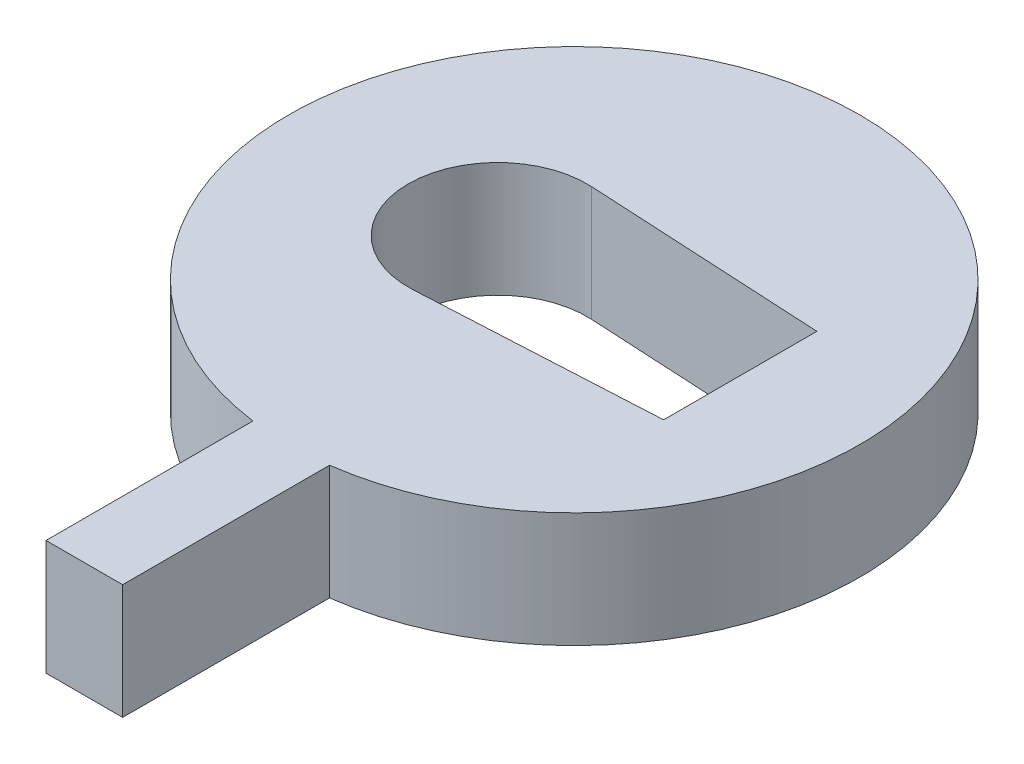
ISO-10303-21;
HEADER;
FILE_DESCRIPTION(('STEP AP214'),'2;1');
FILE_NAME('part.step','',(''),(''),'','','');
FILE_SCHEMA(('AUTOMOTIVE_DESIGN { 1 0 10303 214 1 1 1 1 }'));
ENDSEC;
DATA;
#1=APPLICATION_CONTEXT('core data for automotive mechanical design processes');
#2=APPLICATION_PROTOCOL_DEFINITION('international standard','automotive_design',2000,#1);
#3=PRODUCT_CONTEXT('',#1,'mechanical');
#4=PRODUCT('Part','Part','',(#3));
#5=PRODUCT_RELATED_PRODUCT_CATEGORY('part','',(#4));
#6=PRODUCT_DEFINITION_FORMATION('','',#4);
#7=PRODUCT_DEFINITION_CONTEXT('part definition',#1,'design');
#8=PRODUCT_DEFINITION('design','',#6,#7);
#9=PRODUCT_DEFINITION_SHAPE('','',#8);
#10=(LENGTH_UNIT() NAMED_UNIT(*) SI_UNIT(.MILLI.,.METRE.));
#11=(NAMED_UNIT(*) PLANE_ANGLE_UNIT() SI_UNIT($,.RADIAN.));
#12=(NAMED_UNIT(*) SI_UNIT($,.STERADIAN.) SOLID_ANGLE_UNIT());
#13=UNCERTAINTY_MEASURE_WITH_UNIT(LENGTH_MEASURE(1.E-05),#10,'distance_accuracy_value','');
#14=(GEOMETRIC_REPRESENTATION_CONTEXT(3) GLOBAL_UNCERTAINTY_ASSIGNED_CONTEXT((#13)) GLOBAL_UNIT_ASSIGNED_CONTEXT((#10,
#11,#12)) REPRESENTATION_CONTEXT('',''));
#15=CARTESIAN_POINT('',(0.,0.,0.));
#16=DIRECTION('',(0.,0.,1.));
#17=DIRECTION('',(1.,0.,0.));
#18=AXIS2_PLACEMENT_3D('',#15,#16,#17);
#19=CARTESIAN_POINT('',(0.,4.5,0.));
#20=DIRECTION('',(0.,1.,0.));
#21=DIRECTION('',(0.,0.,1.));
#22=AXIS2_PLACEMENT_3D('',#19,#20,#21);
#23=PLANE('',#22);
#24=CARTESIAN_POINT('',(-3.,4.5,0.));
#25=DIRECTION('',(0.,1.,0.));
#26=DIRECTION('',(0.,0.,1.));
#27=AXIS2_PLACEMENT_3D('',#24,#25,#26);
#28=CIRCLE('',#27,3.5);
#29=CARTESIAN_POINT('',(-2.8142315371026,4.5,-3.49506653415822));
#30=VERTEX_POINT('',#29);
#31=CARTESIAN_POINT('',(-2.81423153710259,4.5,3.49506653415822));
#32=VERTEX_POINT('',#31);
#33=EDGE_CURVE('E168',#30,#32,#28,.T.);
#34=ORIENTED_EDGE('',*,*,#33,.F.);
#35=DIRECTION('',(0.998590438330919,0.,0.053076703684973));
#36=VECTOR('',#35,1.);
#37=CARTESIAN_POINT('',(-2.81423153710259,4.5,-3.49506653415822));
#38=LINE('',#37,#36);
#39=CARTESIAN_POINT('',(6.5,4.5,-3.));
#40=VERTEX_POINT('',#39);
#41=EDGE_CURVE('E172',#30,#40,#38,.T.);
#42=ORIENTED_EDGE('',*,*,#41,.T.);
#43=DIRECTION('',(0.,0.,1.));
#44=VECTOR('',#43,1.);
#45=CARTESIAN_POINT('',(6.5,4.5,-3.));
#46=LINE('',#45,#44);
#47=CARTESIAN_POINT('',(6.5,4.5,3.));
#48=VERTEX_POINT('',#47);
#49=EDGE_CURVE('E150',#40,#48,#46,.T.);
#50=ORIENTED_EDGE('',*,*,#49,.T.);
#51=DIRECTION('',(-0.998590438330919,0.,0.0530767036849733));
#52=VECTOR('',#51,1.);
#53=CARTESIAN_POINT('',(6.5,4.5,3.));
#54=LINE('',#53,#52);
#55=EDGE_CURVE('E70',#48,#32,#54,.T.);
#56=ORIENTED_EDGE('',*,*,#55,.T.);
#57=EDGE_LOOP('',(#34,#42,#50,#56));
#58=FACE_BOUND('',#57,.T.);
#59=CARTESIAN_POINT('',(0.,4.5,0.));
#60=DIRECTION('',(0.,1.,0.));
#61=DIRECTION('',(0.,0.,1.));
#62=AXIS2_PLACEMENT_3D('',#59,#60,#61);
#63=CIRCLE('',#62,11.1803398874989);
#64=CARTESIAN_POINT('',(1.5,4.5,11.0792599030802));
#65=VERTEX_POINT('',#64);
#66=CARTESIAN_POINT('',(-1.5,4.5,11.0792599030802));
#67=VERTEX_POINT('',#66);
#68=EDGE_CURVE('E137',#65,#67,#63,.T.);
#69=ORIENTED_EDGE('',*,*,#68,.T.);
#70=DIRECTION('',(0.,0.,-1.));
#71=VECTOR('',#70,1.);
#72=CARTESIAN_POINT('',(-1.5,4.5,19.1803398874989));
#73=LINE('',#72,#71);
#74=CARTESIAN_POINT('',(-1.5,4.5,19.1803398874989));
#75=VERTEX_POINT('',#74);
#76=EDGE_CURVE('E197',#75,#67,#73,.T.);
#77=ORIENTED_EDGE('',*,*,#76,.F.);
#78=DIRECTION('',(-1.,0.,0.));
#79=VECTOR('',#78,1.);
#80=CARTESIAN_POINT('',(1.5,4.5,19.1803398874989));
#81=LINE('',#80,#79);
#82=CARTESIAN_POINT('',(1.5,4.5,19.1803398874989));
#83=VERTEX_POINT('',#82);
#84=EDGE_CURVE('E128',#83,#75,#81,.T.);
#85=ORIENTED_EDGE('',*,*,#84,.F.);
#86=DIRECTION('',(0.,0.,-1.));
#87=VECTOR('',#86,1.);
#88=CARTESIAN_POINT('',(1.5,4.5,19.1803398874989));
#89=LINE('',#88,#87);
#90=EDGE_CURVE('E144',#83,#65,#89,.T.);
#91=ORIENTED_EDGE('',*,*,#90,.T.);
#92=EDGE_LOOP('',(#69,#77,#85,#91));
#93=FACE_BOUND('',#92,.T.);
#94=ADVANCED_FACE('F47',(#58,#93),#23,.T.);
#95=CARTESIAN_POINT('',(0.,0.,0.));
#96=DIRECTION('',(0.,1.,0.));
#97=DIRECTION('',(0.,0.,1.));
#98=AXIS2_PLACEMENT_3D('',#95,#96,#97);
#99=PLANE('',#98);
#100=DIRECTION('',(0.,0.,-1.));
#101=VECTOR('',#100,1.);
#102=CARTESIAN_POINT('',(-1.5,0.,19.1803398874989));
#103=LINE('',#102,#101);
#104=CARTESIAN_POINT('',(-1.5,0.,19.1803398874989));
#105=VERTEX_POINT('',#104);
#106=CARTESIAN_POINT('',(-1.5,0.,11.0792599030802));
#107=VERTEX_POINT('',#106);
#108=EDGE_CURVE('E116',#105,#107,#103,.T.);
#109=ORIENTED_EDGE('',*,*,#108,.T.);
#110=CARTESIAN_POINT('',(0.,0.,0.));
#111=DIRECTION('',(0.,1.,0.));
#112=DIRECTION('',(0.,0.,1.));
#113=AXIS2_PLACEMENT_3D('',#110,#111,#112);
#114=CIRCLE('',#113,11.1803398874989);
#115=CARTESIAN_POINT('',(1.5,0.,11.0792599030802));
#116=VERTEX_POINT('',#115);
#117=EDGE_CURVE('E142',#107,#116,#114,.F.);
#118=ORIENTED_EDGE('',*,*,#117,.T.);
#119=DIRECTION('',(0.,0.,-1.));
#120=VECTOR('',#119,1.);
#121=CARTESIAN_POINT('',(1.5,0.,19.1803398874989));
#122=LINE('',#121,#120);
#123=CARTESIAN_POINT('',(1.5,0.,19.1803398874989));
#124=VERTEX_POINT('',#123);
#125=EDGE_CURVE('E118',#124,#116,#122,.T.);
#126=ORIENTED_EDGE('',*,*,#125,.F.);
#127=DIRECTION('',(1.,0.,0.));
#128=VECTOR('',#127,1.);
#129=CARTESIAN_POINT('',(-1.5,0.,19.1803398874989));
#130=LINE('',#129,#128);
#131=EDGE_CURVE('E112',#105,#124,#130,.T.);
#132=ORIENTED_EDGE('',*,*,#131,.F.);
#133=EDGE_LOOP('',(#109,#118,#126,#132));
#134=FACE_BOUND('',#133,.T.);
#135=DIRECTION('',(-0.998590438330919,0.,-0.053076703684973));
#136=VECTOR('',#135,1.);
#137=CARTESIAN_POINT('',(-2.81423153710259,0.,-3.49506653415822));
#138=LINE('',#137,#136);
#139=CARTESIAN_POINT('',(6.5,0.,-3.));
#140=VERTEX_POINT('',#139);
#141=CARTESIAN_POINT('',(-2.8142315371026,0.,-3.49506653415822));
#142=VERTEX_POINT('',#141);
#143=EDGE_CURVE('E155',#140,#142,#138,.T.);
#144=ORIENTED_EDGE('',*,*,#143,.T.);
#145=CARTESIAN_POINT('',(-3.,0.,0.));
#146=DIRECTION('',(0.,1.,0.));
#147=DIRECTION('',(0.,0.,1.));
#148=AXIS2_PLACEMENT_3D('',#145,#146,#147);
#149=CIRCLE('',#148,3.5);
#150=CARTESIAN_POINT('',(-2.81423153710259,0.,3.49506653415822));
#151=VERTEX_POINT('',#150);
#152=EDGE_CURVE('E151',#151,#142,#149,.F.);
#153=ORIENTED_EDGE('',*,*,#152,.F.);
#154=DIRECTION('',(0.998590438330919,0.,-0.0530767036849733));
#155=VECTOR('',#154,1.);
#156=CARTESIAN_POINT('',(6.5,0.,3.));
#157=LINE('',#156,#155);
#158=CARTESIAN_POINT('',(6.5,0.,3.));
#159=VERTEX_POINT('',#158);
#160=EDGE_CURVE('E154',#151,#159,#157,.T.);
#161=ORIENTED_EDGE('',*,*,#160,.T.);
#162=DIRECTION('',(0.,0.,-1.));
#163=VECTOR('',#162,1.);
#164=CARTESIAN_POINT('',(6.5,0.,-3.));
#165=LINE('',#164,#163);
#166=EDGE_CURVE('E159',#159,#140,#165,.T.);
#167=ORIENTED_EDGE('',*,*,#166,.T.);
#168=EDGE_LOOP('',(#144,#153,#161,#167));
#169=FACE_BOUND('',#168,.T.);
#170=ADVANCED_FACE('F49',(#134,#169),#99,.F.);
#171=CARTESIAN_POINT('',(0.,-20.9331459920627,0.));
#172=DIRECTION('',(0.,1.,0.));
#173=DIRECTION('',(0.,0.,1.));
#174=AXIS2_PLACEMENT_3D('',#171,#172,#173);
#175=CYLINDRICAL_SURFACE('',#174,11.1803398874989);
#176=ORIENTED_EDGE('',*,*,#117,.F.);
#177=DIRECTION('',(0.,1.,0.));
#178=VECTOR('',#177,1.);
#179=CARTESIAN_POINT('',(-1.5,-20.9331459920627,11.0792599030802));
#180=LINE('',#179,#178);
#181=EDGE_CURVE('E11',#107,#67,#180,.T.);
#182=ORIENTED_EDGE('',*,*,#181,.T.);
#183=ORIENTED_EDGE('',*,*,#68,.F.);
#184=DIRECTION('',(0.,1.,0.));
#185=VECTOR('',#184,1.);
#186=CARTESIAN_POINT('',(1.5,-20.9331459920627,11.0792599030802));
#187=LINE('',#186,#185);
#188=EDGE_CURVE('E56',#116,#65,#187,.T.);
#189=ORIENTED_EDGE('',*,*,#188,.F.);
#190=EDGE_LOOP('',(#176,#182,#183,#189));
#191=FACE_BOUND('',#190,.T.);
#192=ADVANCED_FACE('F204',(#191),#175,.T.);
#193=CARTESIAN_POINT('',(-2.81423153710259,-14.7648230602334,-3.49506653415822));
#194=DIRECTION('',(-0.053076703684973,0.,0.998590438330919));
#195=DIRECTION('',(0.998590438330919,0.,0.053076703684973));
#196=AXIS2_PLACEMENT_3D('',#193,#194,#195);
#197=PLANE('',#196);
#198=DIRECTION('',(0.,1.,0.));
#199=VECTOR('',#198,1.);
#200=CARTESIAN_POINT('',(6.5,-14.7648230602334,-3.));
#201=LINE('',#200,#199);
#202=EDGE_CURVE('E176',#140,#40,#201,.T.);
#203=ORIENTED_EDGE('',*,*,#202,.T.);
#204=ORIENTED_EDGE('',*,*,#41,.F.);
#205=DIRECTION('',(0.,1.,0.));
#206=VECTOR('',#205,1.);
#207=CARTESIAN_POINT('',(-2.8142315371026,-14.7648230602334,-3.49506653415822));
#208=LINE('',#207,#206);
#209=EDGE_CURVE('E179',#142,#30,#208,.T.);
#210=ORIENTED_EDGE('',*,*,#209,.F.);
#211=ORIENTED_EDGE('',*,*,#143,.F.);
#212=EDGE_LOOP('',(#203,#204,#210,#211));
#213=FACE_BOUND('',#212,.T.);
#214=ADVANCED_FACE('F206',(#213),#197,.T.);
#215=CARTESIAN_POINT('',(-3.,-14.7648230602334,0.));
#216=DIRECTION('',(0.,1.,0.));
#217=DIRECTION('',(0.,0.,1.));
#218=AXIS2_PLACEMENT_3D('',#215,#216,#217);
#219=CYLINDRICAL_SURFACE('',#218,3.5);
#220=ORIENTED_EDGE('',*,*,#152,.T.);
#221=ORIENTED_EDGE('',*,*,#209,.T.);
#222=ORIENTED_EDGE('',*,*,#33,.T.);
#223=DIRECTION('',(0.,1.,0.));
#224=VECTOR('',#223,1.);
#225=CARTESIAN_POINT('',(-2.81423153710259,-14.7648230602334,3.49506653415822));
#226=LINE('',#225,#224);
#227=EDGE_CURVE('E182',#151,#32,#226,.T.);
#228=ORIENTED_EDGE('',*,*,#227,.F.);
#229=EDGE_LOOP('',(#220,#221,#222,#228));
#230=FACE_BOUND('',#229,.T.);
#231=ADVANCED_FACE('F213',(#230),#219,.F.);
#232=CARTESIAN_POINT('',(6.5,-14.7648230602334,3.));
#233=DIRECTION('',(-0.0530767036849733,0.,-0.998590438330919));
#234=DIRECTION('',(-0.998590438330919,0.,0.0530767036849733));
#235=AXIS2_PLACEMENT_3D('',#232,#233,#234);
#236=PLANE('',#235);
#237=ORIENTED_EDGE('',*,*,#227,.T.);
#238=ORIENTED_EDGE('',*,*,#55,.F.);
#239=DIRECTION('',(0.,1.,0.));
#240=VECTOR('',#239,1.);
#241=CARTESIAN_POINT('',(6.5,-14.7648230602334,3.));
#242=LINE('',#241,#240);
#243=EDGE_CURVE('E185',#159,#48,#242,.T.);
#244=ORIENTED_EDGE('',*,*,#243,.F.);
#245=ORIENTED_EDGE('',*,*,#160,.F.);
#246=EDGE_LOOP('',(#237,#238,#244,#245));
#247=FACE_BOUND('',#246,.T.);
#248=ADVANCED_FACE('F226',(#247),#236,.T.);
#249=CARTESIAN_POINT('',(6.5,-14.7648230602334,-3.));
#250=DIRECTION('',(-1.,0.,0.));
#251=DIRECTION('',(0.,0.,1.));
#252=AXIS2_PLACEMENT_3D('',#249,#250,#251);
#253=PLANE('',#252);
#254=ORIENTED_EDGE('',*,*,#243,.T.);
#255=ORIENTED_EDGE('',*,*,#49,.F.);
#256=ORIENTED_EDGE('',*,*,#202,.F.);
#257=ORIENTED_EDGE('',*,*,#166,.F.);
#258=EDGE_LOOP('',(#254,#255,#256,#257));
#259=FACE_BOUND('',#258,.T.);
#260=ADVANCED_FACE('F224',(#259),#253,.T.);
#261=CARTESIAN_POINT('',(-1.5,4.5,19.1803398874989));
#262=DIRECTION('',(1.,0.,0.));
#263=DIRECTION('',(0.,0.,-1.));
#264=AXIS2_PLACEMENT_3D('',#261,#262,#263);
#265=PLANE('',#264);
#266=ORIENTED_EDGE('',*,*,#181,.F.);
#267=ORIENTED_EDGE('',*,*,#108,.F.);
#268=DIRECTION('',(0.,-1.,0.));
#269=VECTOR('',#268,1.);
#270=CARTESIAN_POINT('',(-1.5,4.5,19.1803398874989));
#271=LINE('',#270,#269);
#272=EDGE_CURVE('E123',#75,#105,#271,.T.);
#273=ORIENTED_EDGE('',*,*,#272,.F.);
#274=ORIENTED_EDGE('',*,*,#76,.T.);
#275=EDGE_LOOP('',(#266,#267,#273,#274));
#276=FACE_BOUND('',#275,.T.);
#277=ADVANCED_FACE('F135',(#276),#265,.F.);
#278=CARTESIAN_POINT('',(1.5,0.,19.1803398874989));
#279=DIRECTION('',(-1.,0.,0.));
#280=DIRECTION('',(0.,0.,1.));
#281=AXIS2_PLACEMENT_3D('',#278,#279,#280);
#282=PLANE('',#281);
#283=ORIENTED_EDGE('',*,*,#188,.T.);
#284=ORIENTED_EDGE('',*,*,#90,.F.);
#285=DIRECTION('',(0.,1.,0.));
#286=VECTOR('',#285,1.);
#287=CARTESIAN_POINT('',(1.5,0.,19.1803398874989));
#288=LINE('',#287,#286);
#289=EDGE_CURVE('E122',#124,#83,#288,.T.);
#290=ORIENTED_EDGE('',*,*,#289,.F.);
#291=ORIENTED_EDGE('',*,*,#125,.T.);
#292=EDGE_LOOP('',(#283,#284,#290,#291));
#293=FACE_BOUND('',#292,.T.);
#294=ADVANCED_FACE('F194',(#293),#282,.F.);
#295=CARTESIAN_POINT('',(0.,0.,19.1803398874989));
#296=DIRECTION('',(0.,0.,1.));
#297=DIRECTION('',(1.,0.,0.));
#298=AXIS2_PLACEMENT_3D('',#295,#296,#297);
#299=PLANE('',#298);
#300=ORIENTED_EDGE('',*,*,#272,.T.);
#301=ORIENTED_EDGE('',*,*,#131,.T.);
#302=ORIENTED_EDGE('',*,*,#289,.T.);
#303=ORIENTED_EDGE('',*,*,#84,.T.);
#304=EDGE_LOOP('',(#300,#301,#302,#303));
#305=FACE_BOUND('',#304,.T.);
#306=ADVANCED_FACE('F126',(#305),#299,.T.);
#307=CLOSED_SHELL('',(#94,#170,#192,#214,#231,#248,#260,#277,#294,#306));
#308=MANIFOLD_SOLID_BREP('B2',#307);
#309=ADVANCED_BREP_SHAPE_REPRESENTATION('',(#18,#308),#14);
#310=SHAPE_DEFINITION_REPRESENTATION(#9,#309);
ENDSEC;
END-ISO-10303-21;
